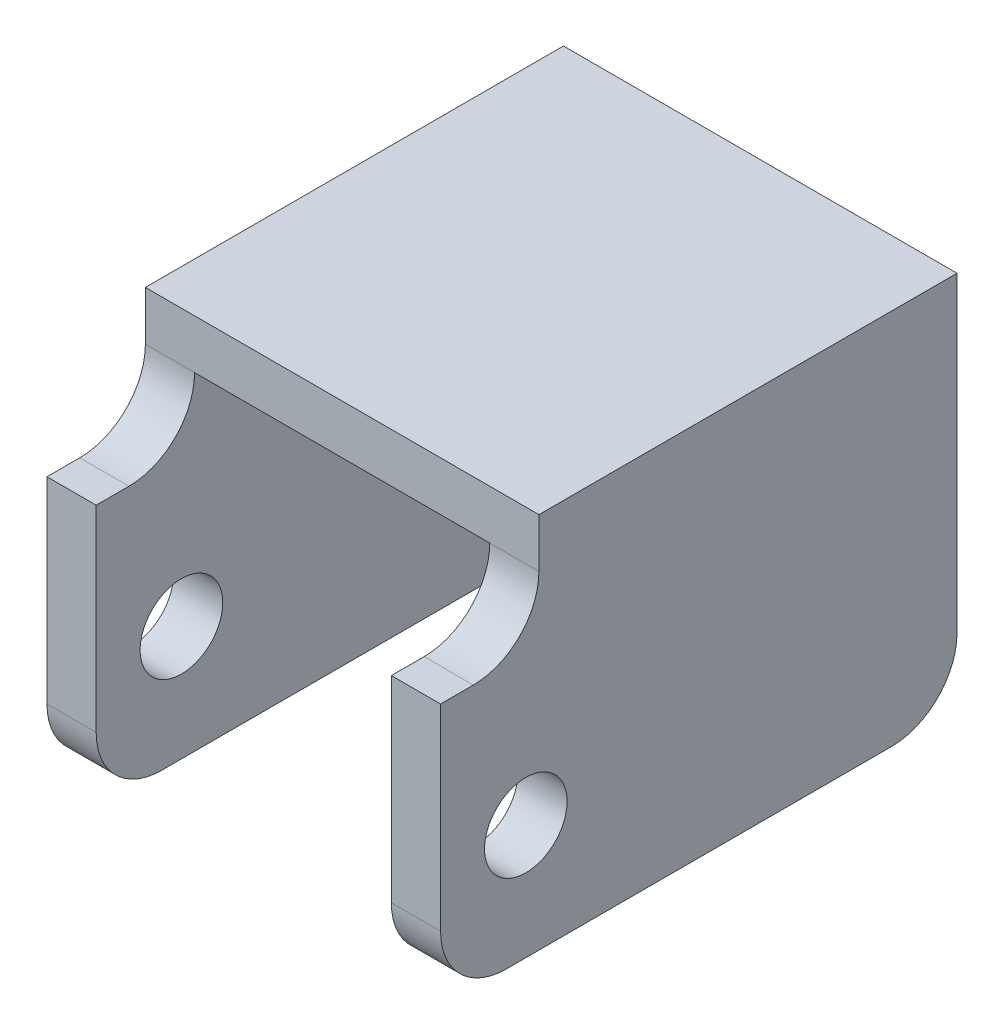
ISO-10303-21;
HEADER;
FILE_DESCRIPTION(('STEP AP214'),'2;1');
FILE_NAME('part.step','',(''),(''),'','','');
FILE_SCHEMA(('AUTOMOTIVE_DESIGN { 1 0 10303 214 1 1 1 1 }'));
ENDSEC;
DATA;
#1=APPLICATION_CONTEXT('core data for automotive mechanical design processes');
#2=APPLICATION_PROTOCOL_DEFINITION('international standard','automotive_design',2000,#1);
#3=PRODUCT_CONTEXT('',#1,'mechanical');
#4=PRODUCT('Part','Part','',(#3));
#5=PRODUCT_RELATED_PRODUCT_CATEGORY('part','',(#4));
#6=PRODUCT_DEFINITION_FORMATION('','',#4);
#7=PRODUCT_DEFINITION_CONTEXT('part definition',#1,'design');
#8=PRODUCT_DEFINITION('design','',#6,#7);
#9=PRODUCT_DEFINITION_SHAPE('','',#8);
#10=(LENGTH_UNIT() NAMED_UNIT(*) SI_UNIT(.MILLI.,.METRE.));
#11=(NAMED_UNIT(*) PLANE_ANGLE_UNIT() SI_UNIT($,.RADIAN.));
#12=(NAMED_UNIT(*) SI_UNIT($,.STERADIAN.) SOLID_ANGLE_UNIT());
#13=UNCERTAINTY_MEASURE_WITH_UNIT(LENGTH_MEASURE(1.E-05),#10,'distance_accuracy_value','');
#14=(GEOMETRIC_REPRESENTATION_CONTEXT(3) GLOBAL_UNCERTAINTY_ASSIGNED_CONTEXT((#13)) GLOBAL_UNIT_ASSIGNED_CONTEXT((#10,
#11,#12)) REPRESENTATION_CONTEXT('',''));
#15=CARTESIAN_POINT('',(0.,0.,0.));
#16=DIRECTION('',(0.,0.,1.));
#17=DIRECTION('',(1.,0.,0.));
#18=AXIS2_PLACEMENT_3D('',#15,#16,#17);
#19=CARTESIAN_POINT('',(-19.05,4.7625,0.));
#20=DIRECTION('',(1.,0.,0.));
#21=DIRECTION('',(0.,0.,-1.));
#22=AXIS2_PLACEMENT_3D('',#19,#20,#21);
#23=PLANE('',#22);
#24=CARTESIAN_POINT('',(-19.05,-20.6375,16.745));
#25=DIRECTION('',(1.,0.,0.));
#26=DIRECTION('',(0.,0.,-1.));
#27=AXIS2_PLACEMENT_3D('',#24,#25,#26);
#28=CIRCLE('',#27,4.);
#29=CARTESIAN_POINT('',(-19.05,-20.6375,12.745));
#30=VERTEX_POINT('',#29);
#31=EDGE_CURVE('E329',#30,#30,#28,.T.);
#32=ORIENTED_EDGE('',*,*,#31,.T.);
#33=EDGE_LOOP('',(#32));
#34=FACE_BOUND('',#33,.T.);
#35=DIRECTION('',(0.,-1.,0.));
#36=VECTOR('',#35,1.);
#37=CARTESIAN_POINT('',(-19.05,4.7625,-25.));
#38=LINE('',#37,#36);
#39=CARTESIAN_POINT('',(-19.05,4.7625,-25.));
#40=VERTEX_POINT('',#39);
#41=CARTESIAN_POINT('',(-19.05,-25.4,-25.));
#42=VERTEX_POINT('',#41);
#43=EDGE_CURVE('E207',#40,#42,#38,.T.);
#44=ORIENTED_EDGE('',*,*,#43,.T.);
#45=CARTESIAN_POINT('',(-19.05,-25.4,-18.65));
#46=DIRECTION('',(1.,0.,0.));
#47=DIRECTION('',(0.,0.,-1.));
#48=AXIS2_PLACEMENT_3D('',#45,#46,#47);
#49=CIRCLE('',#48,6.35);
#50=CARTESIAN_POINT('',(-19.05,-31.75,-18.65));
#51=VERTEX_POINT('',#50);
#52=EDGE_CURVE('E223',#42,#51,#49,.F.);
#53=ORIENTED_EDGE('',*,*,#52,.T.);
#54=DIRECTION('',(0.,0.,1.));
#55=VECTOR('',#54,1.);
#56=CARTESIAN_POINT('',(-19.05,-31.75,0.));
#57=LINE('',#56,#55);
#58=CARTESIAN_POINT('',(-19.05,-31.75,18.65));
#59=VERTEX_POINT('',#58);
#60=EDGE_CURVE('E302',#51,#59,#57,.T.);
#61=ORIENTED_EDGE('',*,*,#60,.T.);
#62=CARTESIAN_POINT('',(-19.05,-25.4,18.65));
#63=DIRECTION('',(1.,0.,0.));
#64=DIRECTION('',(0.,0.,-1.));
#65=AXIS2_PLACEMENT_3D('',#62,#63,#64);
#66=CIRCLE('',#65,6.35);
#67=CARTESIAN_POINT('',(-19.05,-25.4,25.));
#68=VERTEX_POINT('',#67);
#69=EDGE_CURVE('E221',#59,#68,#66,.F.);
#70=ORIENTED_EDGE('',*,*,#69,.T.);
#71=DIRECTION('',(0.,-1.,0.));
#72=VECTOR('',#71,1.);
#73=CARTESIAN_POINT('',(-19.05,4.7625,25.));
#74=LINE('',#73,#72);
#75=CARTESIAN_POINT('',(-19.05,-6.35,25.));
#76=VERTEX_POINT('',#75);
#77=EDGE_CURVE('E204',#76,#68,#74,.T.);
#78=ORIENTED_EDGE('',*,*,#77,.F.);
#79=DIRECTION('',(0.,0.,1.));
#80=VECTOR('',#79,1.);
#81=CARTESIAN_POINT('',(-19.05,-6.35,0.));
#82=LINE('',#81,#80);
#83=CARTESIAN_POINT('',(-19.05,-6.35,21.825));
#84=VERTEX_POINT('',#83);
#85=EDGE_CURVE('E172',#84,#76,#82,.T.);
#86=ORIENTED_EDGE('',*,*,#85,.F.);
#87=CARTESIAN_POINT('',(-19.05,0.,21.825));
#88=DIRECTION('',(1.,0.,0.));
#89=DIRECTION('',(0.,0.,-1.));
#90=AXIS2_PLACEMENT_3D('',#87,#88,#89);
#91=CIRCLE('',#90,6.35);
#92=CARTESIAN_POINT('',(-19.05,0.,15.475));
#93=VERTEX_POINT('',#92);
#94=EDGE_CURVE('E167',#84,#93,#91,.T.);
#95=ORIENTED_EDGE('',*,*,#94,.T.);
#96=DIRECTION('',(0.,1.,0.));
#97=VECTOR('',#96,1.);
#98=CARTESIAN_POINT('',(-19.05,0.,15.475));
#99=LINE('',#98,#97);
#100=CARTESIAN_POINT('',(-19.05,4.7625,15.475));
#101=VERTEX_POINT('',#100);
#102=EDGE_CURVE('E159',#93,#101,#99,.T.);
#103=ORIENTED_EDGE('',*,*,#102,.T.);
#104=DIRECTION('',(0.,0.,1.));
#105=VECTOR('',#104,1.);
#106=CARTESIAN_POINT('',(-19.05,4.7625,0.));
#107=LINE('',#106,#105);
#108=EDGE_CURVE('E163',#40,#101,#107,.T.);
#109=ORIENTED_EDGE('',*,*,#108,.F.);
#110=EDGE_LOOP('',(#44,#53,#61,#70,#78,#86,#95,#103,#109));
#111=FACE_BOUND('',#110,.T.);
#112=ADVANCED_FACE('F39',(#34,#111),#23,.F.);
#113=CARTESIAN_POINT('',(0.,4.7625,25.));
#114=DIRECTION('',(0.,0.,1.));
#115=DIRECTION('',(1.,0.,0.));
#116=AXIS2_PLACEMENT_3D('',#113,#114,#115);
#117=PLANE('',#116);
#118=DIRECTION('',(0.,1.,0.));
#119=VECTOR('',#118,1.);
#120=CARTESIAN_POINT('',(14.2875,-31.75,25.));
#121=LINE('',#120,#119);
#122=CARTESIAN_POINT('',(14.2875,-25.4,25.));
#123=VERTEX_POINT('',#122);
#124=CARTESIAN_POINT('',(14.2875,-6.35,25.));
#125=VERTEX_POINT('',#124);
#126=EDGE_CURVE('E297',#123,#125,#121,.T.);
#127=ORIENTED_EDGE('',*,*,#126,.F.);
#128=DIRECTION('',(1.,0.,0.));
#129=VECTOR('',#128,1.);
#130=CARTESIAN_POINT('',(19.05,-25.4,25.));
#131=LINE('',#130,#129);
#132=CARTESIAN_POINT('',(19.05,-25.4,25.));
#133=VERTEX_POINT('',#132);
#134=EDGE_CURVE('E248',#123,#133,#131,.T.);
#135=ORIENTED_EDGE('',*,*,#134,.T.);
#136=DIRECTION('',(0.,-1.,0.));
#137=VECTOR('',#136,1.);
#138=CARTESIAN_POINT('',(19.05,4.7625,25.));
#139=LINE('',#138,#137);
#140=CARTESIAN_POINT('',(19.05,-6.35,25.));
#141=VERTEX_POINT('',#140);
#142=EDGE_CURVE('E201',#141,#133,#139,.T.);
#143=ORIENTED_EDGE('',*,*,#142,.F.);
#144=DIRECTION('',(1.,0.,0.));
#145=VECTOR('',#144,1.);
#146=CARTESIAN_POINT('',(-19.05,-6.35,25.));
#147=LINE('',#146,#145);
#148=EDGE_CURVE('E182',#125,#141,#147,.T.);
#149=ORIENTED_EDGE('',*,*,#148,.F.);
#150=EDGE_LOOP('',(#127,#135,#143,#149));
#151=FACE_BOUND('',#150,.T.);
#152=ADVANCED_FACE('F351',(#151),#117,.T.);
#153=ORIENTED_EDGE('',*,*,#77,.T.);
#154=DIRECTION('',(-1.,0.,0.));
#155=VECTOR('',#154,1.);
#156=CARTESIAN_POINT('',(-14.2875,-25.4,25.));
#157=LINE('',#156,#155);
#158=CARTESIAN_POINT('',(-14.2875,-25.4,25.));
#159=VERTEX_POINT('',#158);
#160=EDGE_CURVE('E246',#68,#159,#157,.F.);
#161=ORIENTED_EDGE('',*,*,#160,.T.);
#162=DIRECTION('',(0.,1.,0.));
#163=VECTOR('',#162,1.);
#164=CARTESIAN_POINT('',(-14.2875,-31.75,25.));
#165=LINE('',#164,#163);
#166=CARTESIAN_POINT('',(-14.2875,-6.35,25.));
#167=VERTEX_POINT('',#166);
#168=EDGE_CURVE('E308',#159,#167,#165,.T.);
#169=ORIENTED_EDGE('',*,*,#168,.T.);
#170=EDGE_CURVE('E214',#76,#167,#147,.T.);
#171=ORIENTED_EDGE('',*,*,#170,.F.);
#172=EDGE_LOOP('',(#153,#161,#169,#171));
#173=FACE_BOUND('',#172,.T.);
#174=ADVANCED_FACE('F313',(#173),#117,.T.);
#175=CARTESIAN_POINT('',(19.05,4.7625,0.));
#176=DIRECTION('',(1.,0.,0.));
#177=DIRECTION('',(0.,0.,-1.));
#178=AXIS2_PLACEMENT_3D('',#175,#176,#177);
#179=PLANE('',#178);
#180=CARTESIAN_POINT('',(19.05,-20.6375,16.745));
#181=DIRECTION('',(1.,0.,0.));
#182=DIRECTION('',(0.,0.,-1.));
#183=AXIS2_PLACEMENT_3D('',#180,#181,#182);
#184=CIRCLE('',#183,4.);
#185=CARTESIAN_POINT('',(19.05,-20.6375,12.745));
#186=VERTEX_POINT('',#185);
#187=EDGE_CURVE('E270',#186,#186,#184,.T.);
#188=ORIENTED_EDGE('',*,*,#187,.F.);
#189=EDGE_LOOP('',(#188));
#190=FACE_BOUND('',#189,.T.);
#191=DIRECTION('',(0.,0.,1.));
#192=VECTOR('',#191,1.);
#193=CARTESIAN_POINT('',(19.05,-31.75,0.));
#194=LINE('',#193,#192);
#195=CARTESIAN_POINT('',(19.05,-31.75,-18.65));
#196=VERTEX_POINT('',#195);
#197=CARTESIAN_POINT('',(19.05,-31.75,18.65));
#198=VERTEX_POINT('',#197);
#199=EDGE_CURVE('E288',#196,#198,#194,.T.);
#200=ORIENTED_EDGE('',*,*,#199,.F.);
#201=CARTESIAN_POINT('',(19.05,-25.4,-18.65));
#202=DIRECTION('',(1.,0.,0.));
#203=DIRECTION('',(0.,0.,-1.));
#204=AXIS2_PLACEMENT_3D('',#201,#202,#203);
#205=CIRCLE('',#204,6.35);
#206=CARTESIAN_POINT('',(19.05,-25.4,-25.));
#207=VERTEX_POINT('',#206);
#208=EDGE_CURVE('E241',#196,#207,#205,.T.);
#209=ORIENTED_EDGE('',*,*,#208,.T.);
#210=DIRECTION('',(0.,-1.,0.));
#211=VECTOR('',#210,1.);
#212=CARTESIAN_POINT('',(19.05,4.7625,-25.));
#213=LINE('',#212,#211);
#214=CARTESIAN_POINT('',(19.05,4.7625,-25.));
#215=VERTEX_POINT('',#214);
#216=EDGE_CURVE('E190',#215,#207,#213,.T.);
#217=ORIENTED_EDGE('',*,*,#216,.F.);
#218=DIRECTION('',(0.,0.,1.));
#219=VECTOR('',#218,1.);
#220=CARTESIAN_POINT('',(19.05,4.7625,0.));
#221=LINE('',#220,#219);
#222=CARTESIAN_POINT('',(19.05,4.7625,15.475));
#223=VERTEX_POINT('',#222);
#224=EDGE_CURVE('E188',#215,#223,#221,.T.);
#225=ORIENTED_EDGE('',*,*,#224,.T.);
#226=DIRECTION('',(0.,1.,0.));
#227=VECTOR('',#226,1.);
#228=CARTESIAN_POINT('',(19.05,0.,15.475));
#229=LINE('',#228,#227);
#230=CARTESIAN_POINT('',(19.05,0.,15.475));
#231=VERTEX_POINT('',#230);
#232=EDGE_CURVE('E178',#231,#223,#229,.T.);
#233=ORIENTED_EDGE('',*,*,#232,.F.);
#234=CARTESIAN_POINT('',(19.05,0.,21.825));
#235=DIRECTION('',(1.,0.,0.));
#236=DIRECTION('',(0.,0.,-1.));
#237=AXIS2_PLACEMENT_3D('',#234,#235,#236);
#238=CIRCLE('',#237,6.35);
#239=CARTESIAN_POINT('',(19.05,-6.35,21.825));
#240=VERTEX_POINT('',#239);
#241=EDGE_CURVE('E47',#231,#240,#238,.F.);
#242=ORIENTED_EDGE('',*,*,#241,.T.);
#243=DIRECTION('',(0.,0.,1.));
#244=VECTOR('',#243,1.);
#245=CARTESIAN_POINT('',(19.05,-6.35,0.));
#246=LINE('',#245,#244);
#247=EDGE_CURVE('E263',#240,#141,#246,.T.);
#248=ORIENTED_EDGE('',*,*,#247,.T.);
#249=ORIENTED_EDGE('',*,*,#142,.T.);
#250=CARTESIAN_POINT('',(19.05,-25.4,18.65));
#251=DIRECTION('',(1.,0.,0.));
#252=DIRECTION('',(0.,0.,-1.));
#253=AXIS2_PLACEMENT_3D('',#250,#251,#252);
#254=CIRCLE('',#253,6.35);
#255=EDGE_CURVE('E239',#133,#198,#254,.T.);
#256=ORIENTED_EDGE('',*,*,#255,.T.);
#257=EDGE_LOOP('',(#200,#209,#217,#225,#233,#242,#248,#249,#256));
#258=FACE_BOUND('',#257,.T.);
#259=ADVANCED_FACE('F262',(#190,#258),#179,.T.);
#260=CARTESIAN_POINT('',(-14.2875,-31.75,0.));
#261=DIRECTION('',(1.,0.,0.));
#262=DIRECTION('',(0.,0.,-1.));
#263=AXIS2_PLACEMENT_3D('',#260,#261,#262);
#264=PLANE('',#263);
#265=CARTESIAN_POINT('',(-14.2875,-20.6375,16.745));
#266=DIRECTION('',(1.,0.,0.));
#267=DIRECTION('',(0.,0.,-1.));
#268=AXIS2_PLACEMENT_3D('',#265,#266,#267);
#269=CIRCLE('',#268,4.);
#270=CARTESIAN_POINT('',(-14.2875,-20.6375,12.745));
#271=VERTEX_POINT('',#270);
#272=EDGE_CURVE('E213',#271,#271,#269,.T.);
#273=ORIENTED_EDGE('',*,*,#272,.F.);
#274=EDGE_LOOP('',(#273));
#275=FACE_BOUND('',#274,.T.);
#276=DIRECTION('',(0.,0.,-1.));
#277=VECTOR('',#276,1.);
#278=CARTESIAN_POINT('',(-14.2875,-31.75,0.));
#279=LINE('',#278,#277);
#280=CARTESIAN_POINT('',(-14.2875,-31.75,18.65));
#281=VERTEX_POINT('',#280);
#282=CARTESIAN_POINT('',(-14.2875,-31.75,-18.65));
#283=VERTEX_POINT('',#282);
#284=EDGE_CURVE('E305',#281,#283,#279,.T.);
#285=ORIENTED_EDGE('',*,*,#284,.T.);
#286=CARTESIAN_POINT('',(-14.2875,-25.4,-18.65));
#287=DIRECTION('',(1.,0.,0.));
#288=DIRECTION('',(0.,0.,-1.));
#289=AXIS2_PLACEMENT_3D('',#286,#287,#288);
#290=CIRCLE('',#289,6.35);
#291=CARTESIAN_POINT('',(-14.2875,-25.4,-25.));
#292=VERTEX_POINT('',#291);
#293=EDGE_CURVE('E232',#283,#292,#290,.T.);
#294=ORIENTED_EDGE('',*,*,#293,.T.);
#295=DIRECTION('',(0.,1.,0.));
#296=VECTOR('',#295,1.);
#297=CARTESIAN_POINT('',(-14.2875,-31.75,-25.));
#298=LINE('',#297,#296);
#299=CARTESIAN_POINT('',(-14.2875,0.,-25.));
#300=VERTEX_POINT('',#299);
#301=EDGE_CURVE('E198',#292,#300,#298,.T.);
#302=ORIENTED_EDGE('',*,*,#301,.T.);
#303=DIRECTION('',(0.,0.,-1.));
#304=VECTOR('',#303,1.);
#305=CARTESIAN_POINT('',(-14.2875,0.,0.));
#306=LINE('',#305,#304);
#307=CARTESIAN_POINT('',(-14.2875,0.,15.475));
#308=VERTEX_POINT('',#307);
#309=EDGE_CURVE('E299',#308,#300,#306,.T.);
#310=ORIENTED_EDGE('',*,*,#309,.F.);
#311=CARTESIAN_POINT('',(-14.2875,0.,21.825));
#312=DIRECTION('',(1.,0.,0.));
#313=DIRECTION('',(0.,0.,-1.));
#314=AXIS2_PLACEMENT_3D('',#311,#312,#313);
#315=CIRCLE('',#314,6.35);
#316=CARTESIAN_POINT('',(-14.2875,-6.35,21.825));
#317=VERTEX_POINT('',#316);
#318=EDGE_CURVE('E258',#308,#317,#315,.F.);
#319=ORIENTED_EDGE('',*,*,#318,.T.);
#320=DIRECTION('',(0.,0.,1.));
#321=VECTOR('',#320,1.);
#322=CARTESIAN_POINT('',(-14.2875,-6.35,0.));
#323=LINE('',#322,#321);
#324=EDGE_CURVE('E285',#317,#167,#323,.T.);
#325=ORIENTED_EDGE('',*,*,#324,.T.);
#326=ORIENTED_EDGE('',*,*,#168,.F.);
#327=CARTESIAN_POINT('',(-14.2875,-25.4,18.65));
#328=DIRECTION('',(1.,0.,0.));
#329=DIRECTION('',(0.,0.,-1.));
#330=AXIS2_PLACEMENT_3D('',#327,#328,#329);
#331=CIRCLE('',#330,6.35);
#332=EDGE_CURVE('E230',#159,#281,#331,.T.);
#333=ORIENTED_EDGE('',*,*,#332,.T.);
#334=EDGE_LOOP('',(#285,#294,#302,#310,#319,#325,#326,#333));
#335=FACE_BOUND('',#334,.T.);
#336=ADVANCED_FACE('F320',(#275,#335),#264,.T.);
#337=CARTESIAN_POINT('',(14.2875,-31.75,0.));
#338=DIRECTION('',(1.,0.,0.));
#339=DIRECTION('',(0.,0.,-1.));
#340=AXIS2_PLACEMENT_3D('',#337,#338,#339);
#341=PLANE('',#340);
#342=CARTESIAN_POINT('',(14.2875,-20.6375,16.745));
#343=DIRECTION('',(1.,0.,0.));
#344=DIRECTION('',(0.,0.,-1.));
#345=AXIS2_PLACEMENT_3D('',#342,#343,#344);
#346=CIRCLE('',#345,4.);
#347=CARTESIAN_POINT('',(14.2875,-20.6375,12.745));
#348=VERTEX_POINT('',#347);
#349=EDGE_CURVE('E210',#348,#348,#346,.T.);
#350=ORIENTED_EDGE('',*,*,#349,.T.);
#351=EDGE_LOOP('',(#350));
#352=FACE_BOUND('',#351,.T.);
#353=DIRECTION('',(0.,1.,0.));
#354=VECTOR('',#353,1.);
#355=CARTESIAN_POINT('',(14.2875,-31.75,-25.));
#356=LINE('',#355,#354);
#357=CARTESIAN_POINT('',(14.2875,-25.4,-25.));
#358=VERTEX_POINT('',#357);
#359=CARTESIAN_POINT('',(14.2875,0.,-25.));
#360=VERTEX_POINT('',#359);
#361=EDGE_CURVE('E300',#358,#360,#356,.T.);
#362=ORIENTED_EDGE('',*,*,#361,.F.);
#363=CARTESIAN_POINT('',(14.2875,-25.4,-18.65));
#364=DIRECTION('',(1.,0.,0.));
#365=DIRECTION('',(0.,0.,-1.));
#366=AXIS2_PLACEMENT_3D('',#363,#364,#365);
#367=CIRCLE('',#366,6.35);
#368=CARTESIAN_POINT('',(14.2875,-31.75,-18.65));
#369=VERTEX_POINT('',#368);
#370=EDGE_CURVE('E244',#358,#369,#367,.F.);
#371=ORIENTED_EDGE('',*,*,#370,.T.);
#372=DIRECTION('',(0.,0.,-1.));
#373=VECTOR('',#372,1.);
#374=CARTESIAN_POINT('',(14.2875,-31.75,0.));
#375=LINE('',#374,#373);
#376=CARTESIAN_POINT('',(14.2875,-31.75,18.65));
#377=VERTEX_POINT('',#376);
#378=EDGE_CURVE('E291',#377,#369,#375,.T.);
#379=ORIENTED_EDGE('',*,*,#378,.F.);
#380=CARTESIAN_POINT('',(14.2875,-25.4,18.65));
#381=DIRECTION('',(1.,0.,0.));
#382=DIRECTION('',(0.,0.,-1.));
#383=AXIS2_PLACEMENT_3D('',#380,#381,#382);
#384=CIRCLE('',#383,6.35);
#385=EDGE_CURVE('E54',#377,#123,#384,.F.);
#386=ORIENTED_EDGE('',*,*,#385,.T.);
#387=ORIENTED_EDGE('',*,*,#126,.T.);
#388=DIRECTION('',(0.,0.,1.));
#389=VECTOR('',#388,1.);
#390=CARTESIAN_POINT('',(14.2875,-6.35,0.));
#391=LINE('',#390,#389);
#392=CARTESIAN_POINT('',(14.2875,-6.35,21.825));
#393=VERTEX_POINT('',#392);
#394=EDGE_CURVE('E209',#393,#125,#391,.T.);
#395=ORIENTED_EDGE('',*,*,#394,.F.);
#396=CARTESIAN_POINT('',(14.2875,0.,21.825));
#397=DIRECTION('',(1.,0.,0.));
#398=DIRECTION('',(0.,0.,-1.));
#399=AXIS2_PLACEMENT_3D('',#396,#397,#398);
#400=CIRCLE('',#399,6.35);
#401=CARTESIAN_POINT('',(14.2875,0.,15.475));
#402=VERTEX_POINT('',#401);
#403=EDGE_CURVE('E11',#393,#402,#400,.T.);
#404=ORIENTED_EDGE('',*,*,#403,.T.);
#405=DIRECTION('',(0.,0.,-1.));
#406=VECTOR('',#405,1.);
#407=CARTESIAN_POINT('',(14.2875,0.,0.));
#408=LINE('',#407,#406);
#409=EDGE_CURVE('E278',#402,#360,#408,.T.);
#410=ORIENTED_EDGE('',*,*,#409,.T.);
#411=EDGE_LOOP('',(#362,#371,#379,#386,#387,#395,#404,#410));
#412=FACE_BOUND('',#411,.T.);
#413=ADVANCED_FACE('F276',(#352,#412),#341,.F.);
#414=CARTESIAN_POINT('',(0.,0.,0.));
#415=DIRECTION('',(0.,1.,0.));
#416=DIRECTION('',(0.,0.,1.));
#417=AXIS2_PLACEMENT_3D('',#414,#415,#416);
#418=PLANE('',#417);
#419=ORIENTED_EDGE('',*,*,#409,.F.);
#420=DIRECTION('',(-1.,0.,0.));
#421=VECTOR('',#420,1.);
#422=CARTESIAN_POINT('',(0.,0.,15.475));
#423=LINE('',#422,#421);
#424=EDGE_CURVE('E281',#402,#308,#423,.T.);
#425=ORIENTED_EDGE('',*,*,#424,.T.);
#426=ORIENTED_EDGE('',*,*,#309,.T.);
#427=DIRECTION('',(-1.,0.,0.));
#428=VECTOR('',#427,1.);
#429=CARTESIAN_POINT('',(0.,0.,-25.));
#430=LINE('',#429,#428);
#431=EDGE_CURVE('E192',#360,#300,#430,.T.);
#432=ORIENTED_EDGE('',*,*,#431,.F.);
#433=EDGE_LOOP('',(#419,#425,#426,#432));
#434=FACE_BOUND('',#433,.T.);
#435=ADVANCED_FACE('F287',(#434),#418,.F.);
#436=CARTESIAN_POINT('',(0.,4.7625,-25.));
#437=DIRECTION('',(0.,0.,1.));
#438=DIRECTION('',(1.,0.,0.));
#439=AXIS2_PLACEMENT_3D('',#436,#437,#438);
#440=PLANE('',#439);
#441=ORIENTED_EDGE('',*,*,#301,.F.);
#442=DIRECTION('',(-1.,0.,0.));
#443=VECTOR('',#442,1.);
#444=CARTESIAN_POINT('',(0.,-25.4,-25.));
#445=LINE('',#444,#443);
#446=EDGE_CURVE('E218',#292,#42,#445,.T.);
#447=ORIENTED_EDGE('',*,*,#446,.T.);
#448=ORIENTED_EDGE('',*,*,#43,.F.);
#449=DIRECTION('',(-1.,0.,0.));
#450=VECTOR('',#449,1.);
#451=CARTESIAN_POINT('',(0.,4.7625,-25.));
#452=LINE('',#451,#450);
#453=EDGE_CURVE('E186',#215,#40,#452,.T.);
#454=ORIENTED_EDGE('',*,*,#453,.F.);
#455=ORIENTED_EDGE('',*,*,#216,.T.);
#456=DIRECTION('',(1.,0.,0.));
#457=VECTOR('',#456,1.);
#458=CARTESIAN_POINT('',(0.,-25.4,-25.));
#459=LINE('',#458,#457);
#460=EDGE_CURVE('E216',#207,#358,#459,.F.);
#461=ORIENTED_EDGE('',*,*,#460,.T.);
#462=ORIENTED_EDGE('',*,*,#361,.T.);
#463=ORIENTED_EDGE('',*,*,#431,.T.);
#464=EDGE_LOOP('',(#441,#447,#448,#454,#455,#461,#462,#463));
#465=FACE_BOUND('',#464,.T.);
#466=ADVANCED_FACE('F360',(#465),#440,.F.);
#467=CARTESIAN_POINT('',(0.,4.7625,0.));
#468=DIRECTION('',(0.,1.,0.));
#469=DIRECTION('',(0.,0.,1.));
#470=AXIS2_PLACEMENT_3D('',#467,#468,#469);
#471=PLANE('',#470);
#472=DIRECTION('',(1.,0.,0.));
#473=VECTOR('',#472,1.);
#474=CARTESIAN_POINT('',(-19.05,4.7625,15.475));
#475=LINE('',#474,#473);
#476=EDGE_CURVE('E171',#101,#223,#475,.T.);
#477=ORIENTED_EDGE('',*,*,#476,.T.);
#478=ORIENTED_EDGE('',*,*,#224,.F.);
#479=ORIENTED_EDGE('',*,*,#453,.T.);
#480=ORIENTED_EDGE('',*,*,#108,.T.);
#481=EDGE_LOOP('',(#477,#478,#479,#480));
#482=FACE_BOUND('',#481,.T.);
#483=ADVANCED_FACE('F184',(#482),#471,.T.);
#484=CARTESIAN_POINT('',(0.,-31.75,0.));
#485=DIRECTION('',(0.,1.,0.));
#486=DIRECTION('',(0.,0.,1.));
#487=AXIS2_PLACEMENT_3D('',#484,#485,#486);
#488=PLANE('',#487);
#489=ORIENTED_EDGE('',*,*,#60,.F.);
#490=DIRECTION('',(-1.,0.,0.));
#491=VECTOR('',#490,1.);
#492=CARTESIAN_POINT('',(0.,-31.75,-18.65));
#493=LINE('',#492,#491);
#494=EDGE_CURVE('E228',#51,#283,#493,.F.);
#495=ORIENTED_EDGE('',*,*,#494,.T.);
#496=ORIENTED_EDGE('',*,*,#284,.F.);
#497=DIRECTION('',(-1.,0.,0.));
#498=VECTOR('',#497,1.);
#499=CARTESIAN_POINT('',(-19.05,-31.75,18.65));
#500=LINE('',#499,#498);
#501=EDGE_CURVE('E225',#281,#59,#500,.T.);
#502=ORIENTED_EDGE('',*,*,#501,.T.);
#503=EDGE_LOOP('',(#489,#495,#496,#502));
#504=FACE_BOUND('',#503,.T.);
#505=ADVANCED_FACE('F391',(#504),#488,.F.);
#506=CARTESIAN_POINT('',(0.,-31.75,0.));
#507=DIRECTION('',(0.,1.,0.));
#508=DIRECTION('',(0.,0.,1.));
#509=AXIS2_PLACEMENT_3D('',#506,#507,#508);
#510=PLANE('',#509);
#511=ORIENTED_EDGE('',*,*,#378,.T.);
#512=DIRECTION('',(1.,0.,0.));
#513=VECTOR('',#512,1.);
#514=CARTESIAN_POINT('',(0.,-31.75,-18.65));
#515=LINE('',#514,#513);
#516=EDGE_CURVE('E236',#369,#196,#515,.T.);
#517=ORIENTED_EDGE('',*,*,#516,.T.);
#518=ORIENTED_EDGE('',*,*,#199,.T.);
#519=DIRECTION('',(1.,0.,0.));
#520=VECTOR('',#519,1.);
#521=CARTESIAN_POINT('',(14.2875,-31.75,18.65));
#522=LINE('',#521,#520);
#523=EDGE_CURVE('E234',#198,#377,#522,.F.);
#524=ORIENTED_EDGE('',*,*,#523,.T.);
#525=EDGE_LOOP('',(#511,#517,#518,#524));
#526=FACE_BOUND('',#525,.T.);
#527=ADVANCED_FACE('F400',(#526),#510,.F.);
#528=CARTESIAN_POINT('',(-19.05,-20.6375,16.745));
#529=DIRECTION('',(1.,0.,0.));
#530=DIRECTION('',(0.,0.,-1.));
#531=AXIS2_PLACEMENT_3D('',#528,#529,#530);
#532=CYLINDRICAL_SURFACE('',#531,4.);
#533=ORIENTED_EDGE('',*,*,#187,.T.);
#534=EDGE_LOOP('',(#533));
#535=FACE_BOUND('',#534,.T.);
#536=ORIENTED_EDGE('',*,*,#349,.F.);
#537=EDGE_LOOP('',(#536));
#538=FACE_BOUND('',#537,.T.);
#539=ADVANCED_FACE('F404',(#535,#538),#532,.F.);
#540=CARTESIAN_POINT('',(-19.05,-6.35,0.));
#541=DIRECTION('',(0.,1.,0.));
#542=DIRECTION('',(0.,0.,1.));
#543=AXIS2_PLACEMENT_3D('',#540,#541,#542);
#544=PLANE('',#543);
#545=ORIENTED_EDGE('',*,*,#247,.F.);
#546=DIRECTION('',(1.,0.,0.));
#547=VECTOR('',#546,1.);
#548=CARTESIAN_POINT('',(-19.05,-6.35,21.825));
#549=LINE('',#548,#547);
#550=EDGE_CURVE('E62',#240,#393,#549,.F.);
#551=ORIENTED_EDGE('',*,*,#550,.T.);
#552=ORIENTED_EDGE('',*,*,#394,.T.);
#553=ORIENTED_EDGE('',*,*,#148,.T.);
#554=EDGE_LOOP('',(#545,#551,#552,#553));
#555=FACE_BOUND('',#554,.T.);
#556=ADVANCED_FACE('F267',(#555),#544,.T.);
#557=ORIENTED_EDGE('',*,*,#324,.F.);
#558=DIRECTION('',(1.,0.,0.));
#559=VECTOR('',#558,1.);
#560=CARTESIAN_POINT('',(-19.05,-6.35,21.825));
#561=LINE('',#560,#559);
#562=EDGE_CURVE('E255',#317,#84,#561,.F.);
#563=ORIENTED_EDGE('',*,*,#562,.T.);
#564=ORIENTED_EDGE('',*,*,#85,.T.);
#565=ORIENTED_EDGE('',*,*,#170,.T.);
#566=EDGE_LOOP('',(#557,#563,#564,#565));
#567=FACE_BOUND('',#566,.T.);
#568=ADVANCED_FACE('F323',(#567),#544,.T.);
#569=CARTESIAN_POINT('',(-19.05,0.,15.475));
#570=DIRECTION('',(0.,0.,-1.));
#571=DIRECTION('',(0.,1.,0.));
#572=AXIS2_PLACEMENT_3D('',#569,#570,#571);
#573=PLANE('',#572);
#574=ORIENTED_EDGE('',*,*,#102,.F.);
#575=DIRECTION('',(1.,0.,0.));
#576=VECTOR('',#575,1.);
#577=CARTESIAN_POINT('',(-19.05,0.,15.475));
#578=LINE('',#577,#576);
#579=EDGE_CURVE('E253',#93,#308,#578,.T.);
#580=ORIENTED_EDGE('',*,*,#579,.T.);
#581=ORIENTED_EDGE('',*,*,#424,.F.);
#582=DIRECTION('',(1.,0.,0.));
#583=VECTOR('',#582,1.);
#584=CARTESIAN_POINT('',(-19.05,0.,15.475));
#585=LINE('',#584,#583);
#586=EDGE_CURVE('E251',#402,#231,#585,.T.);
#587=ORIENTED_EDGE('',*,*,#586,.T.);
#588=ORIENTED_EDGE('',*,*,#232,.T.);
#589=ORIENTED_EDGE('',*,*,#476,.F.);
#590=EDGE_LOOP('',(#574,#580,#581,#587,#588,#589));
#591=FACE_BOUND('',#590,.T.);
#592=ADVANCED_FACE('F175',(#591),#573,.F.);
#593=ORIENTED_EDGE('',*,*,#272,.T.);
#594=EDGE_LOOP('',(#593));
#595=FACE_BOUND('',#594,.T.);
#596=ORIENTED_EDGE('',*,*,#31,.F.);
#597=EDGE_LOOP('',(#596));
#598=FACE_BOUND('',#597,.T.);
#599=ADVANCED_FACE('F335',(#595,#598),#532,.F.);
#600=CARTESIAN_POINT('',(0.,-25.4,-18.65));
#601=DIRECTION('',(-1.,0.,0.));
#602=DIRECTION('',(0.,0.,1.));
#603=AXIS2_PLACEMENT_3D('',#600,#601,#602);
#604=CYLINDRICAL_SURFACE('',#603,6.35);
#605=ORIENTED_EDGE('',*,*,#293,.F.);
#606=ORIENTED_EDGE('',*,*,#494,.F.);
#607=ORIENTED_EDGE('',*,*,#52,.F.);
#608=ORIENTED_EDGE('',*,*,#446,.F.);
#609=EDGE_LOOP('',(#605,#606,#607,#608));
#610=FACE_BOUND('',#609,.T.);
#611=ADVANCED_FACE('F364',(#610),#604,.T.);
#612=CARTESIAN_POINT('',(0.,-25.4,-18.65));
#613=DIRECTION('',(1.,0.,0.));
#614=DIRECTION('',(0.,0.,-1.));
#615=AXIS2_PLACEMENT_3D('',#612,#613,#614);
#616=CYLINDRICAL_SURFACE('',#615,6.35);
#617=ORIENTED_EDGE('',*,*,#370,.F.);
#618=ORIENTED_EDGE('',*,*,#460,.F.);
#619=ORIENTED_EDGE('',*,*,#208,.F.);
#620=ORIENTED_EDGE('',*,*,#516,.F.);
#621=EDGE_LOOP('',(#617,#618,#619,#620));
#622=FACE_BOUND('',#621,.T.);
#623=ADVANCED_FACE('F367',(#622),#616,.T.);
#624=CARTESIAN_POINT('',(0.,-25.4,18.65));
#625=DIRECTION('',(1.,0.,0.));
#626=DIRECTION('',(0.,0.,-1.));
#627=AXIS2_PLACEMENT_3D('',#624,#625,#626);
#628=CYLINDRICAL_SURFACE('',#627,6.35);
#629=ORIENTED_EDGE('',*,*,#332,.F.);
#630=ORIENTED_EDGE('',*,*,#160,.F.);
#631=ORIENTED_EDGE('',*,*,#69,.F.);
#632=ORIENTED_EDGE('',*,*,#501,.F.);
#633=EDGE_LOOP('',(#629,#630,#631,#632));
#634=FACE_BOUND('',#633,.T.);
#635=ADVANCED_FACE('F371',(#634),#628,.T.);
#636=CARTESIAN_POINT('',(0.,-25.4,18.65));
#637=DIRECTION('',(-1.,0.,0.));
#638=DIRECTION('',(0.,0.,1.));
#639=AXIS2_PLACEMENT_3D('',#636,#637,#638);
#640=CYLINDRICAL_SURFACE('',#639,6.35);
#641=ORIENTED_EDGE('',*,*,#385,.F.);
#642=ORIENTED_EDGE('',*,*,#523,.F.);
#643=ORIENTED_EDGE('',*,*,#255,.F.);
#644=ORIENTED_EDGE('',*,*,#134,.F.);
#645=EDGE_LOOP('',(#641,#642,#643,#644));
#646=FACE_BOUND('',#645,.T.);
#647=ADVANCED_FACE('F375',(#646),#640,.T.);
#648=CARTESIAN_POINT('',(-19.05,0.,21.825));
#649=DIRECTION('',(1.,0.,0.));
#650=DIRECTION('',(0.,0.,-1.));
#651=AXIS2_PLACEMENT_3D('',#648,#649,#650);
#652=CYLINDRICAL_SURFACE('',#651,6.35);
#653=ORIENTED_EDGE('',*,*,#94,.F.);
#654=ORIENTED_EDGE('',*,*,#562,.F.);
#655=ORIENTED_EDGE('',*,*,#318,.F.);
#656=ORIENTED_EDGE('',*,*,#579,.F.);
#657=EDGE_LOOP('',(#653,#654,#655,#656));
#658=FACE_BOUND('',#657,.T.);
#659=ADVANCED_FACE('F378',(#658),#652,.F.);
#660=CARTESIAN_POINT('',(-19.05,0.,21.825));
#661=DIRECTION('',(1.,0.,0.));
#662=DIRECTION('',(0.,0.,-1.));
#663=AXIS2_PLACEMENT_3D('',#660,#661,#662);
#664=CYLINDRICAL_SURFACE('',#663,6.35);
#665=ORIENTED_EDGE('',*,*,#403,.F.);
#666=ORIENTED_EDGE('',*,*,#550,.F.);
#667=ORIENTED_EDGE('',*,*,#241,.F.);
#668=ORIENTED_EDGE('',*,*,#586,.F.);
#669=EDGE_LOOP('',(#665,#666,#667,#668));
#670=FACE_BOUND('',#669,.T.);
#671=ADVANCED_FACE('F41',(#670),#664,.F.);
#672=CLOSED_SHELL('',(#112,#152,#174,#259,#336,#413,#435,#466,#483,#505,#527,#539,#556,#568,
#592,#599,#611,#623,#635,#647,#659,#671));
#673=MANIFOLD_SOLID_BREP('B2',#672);
#674=ADVANCED_BREP_SHAPE_REPRESENTATION('',(#18,#673),#14);
#675=SHAPE_DEFINITION_REPRESENTATION(#9,#674);
ENDSEC;
END-ISO-10303-21;
